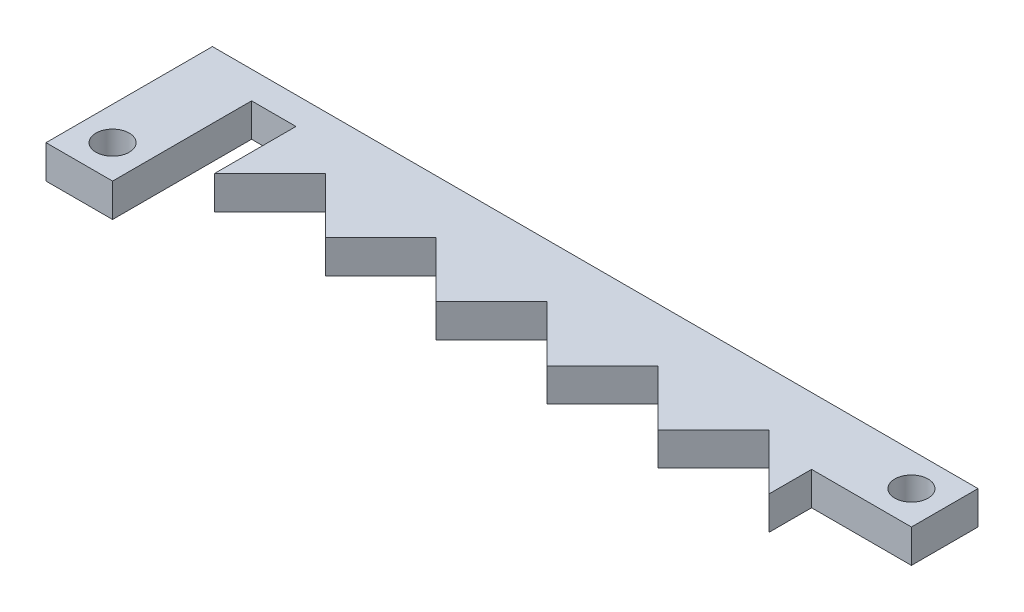
ISO-10303-21;
HEADER;
FILE_DESCRIPTION(('STEP AP214'),'2;1');
FILE_NAME('part.step','',(''),(''),'','','');
FILE_SCHEMA(('AUTOMOTIVE_DESIGN { 1 0 10303 214 1 1 1 1 }'));
ENDSEC;
DATA;
#1=APPLICATION_CONTEXT('core data for automotive mechanical design processes');
#2=APPLICATION_PROTOCOL_DEFINITION('international standard','automotive_design',2000,#1);
#3=PRODUCT_CONTEXT('',#1,'mechanical');
#4=PRODUCT('Part','Part','',(#3));
#5=PRODUCT_RELATED_PRODUCT_CATEGORY('part','',(#4));
#6=PRODUCT_DEFINITION_FORMATION('','',#4);
#7=PRODUCT_DEFINITION_CONTEXT('part definition',#1,'design');
#8=PRODUCT_DEFINITION('design','',#6,#7);
#9=PRODUCT_DEFINITION_SHAPE('','',#8);
#10=(LENGTH_UNIT() NAMED_UNIT(*) SI_UNIT(.MILLI.,.METRE.));
#11=(NAMED_UNIT(*) PLANE_ANGLE_UNIT() SI_UNIT($,.RADIAN.));
#12=(NAMED_UNIT(*) SI_UNIT($,.STERADIAN.) SOLID_ANGLE_UNIT());
#13=UNCERTAINTY_MEASURE_WITH_UNIT(LENGTH_MEASURE(1.E-05),#10,'distance_accuracy_value','');
#14=(GEOMETRIC_REPRESENTATION_CONTEXT(3) GLOBAL_UNCERTAINTY_ASSIGNED_CONTEXT((#13)) GLOBAL_UNIT_ASSIGNED_CONTEXT((#10,
#11,#12)) REPRESENTATION_CONTEXT('',''));
#15=CARTESIAN_POINT('',(0.,0.,0.));
#16=DIRECTION('',(0.,0.,1.));
#17=DIRECTION('',(1.,0.,0.));
#18=AXIS2_PLACEMENT_3D('',#15,#16,#17);
#19=CARTESIAN_POINT('',(0.,3.,0.));
#20=DIRECTION('',(0.,1.,0.));
#21=DIRECTION('',(0.,0.,1.));
#22=AXIS2_PLACEMENT_3D('',#19,#20,#21);
#23=PLANE('',#22);
#24=CARTESIAN_POINT('',(-7.,3.,-36.1687627456537));
#25=DIRECTION('',(0.,1.,0.));
#26=DIRECTION('',(0.,0.,1.));
#27=AXIS2_PLACEMENT_3D('',#24,#25,#26);
#28=CIRCLE('',#27,1.5);
#29=CARTESIAN_POINT('',(-7.,3.,-34.6687627456537));
#30=VERTEX_POINT('',#29);
#31=EDGE_CURVE('E200',#30,#30,#28,.T.);
#32=ORIENTED_EDGE('',*,*,#31,.F.);
#33=EDGE_LOOP('',(#32));
#34=FACE_BOUND('',#33,.T.);
#35=DIRECTION('',(-1.,0.,0.));
#36=VECTOR('',#35,1.);
#37=CARTESIAN_POINT('',(5.,3.,-48.1687627456537));
#38=LINE('',#37,#36);
#39=CARTESIAN_POINT('',(59.,3.,-48.1687627456537));
#40=VERTEX_POINT('',#39);
#41=CARTESIAN_POINT('',(-10.,3.,-48.1687627456537));
#42=VERTEX_POINT('',#41);
#43=EDGE_CURVE('E50',#40,#42,#38,.T.);
#44=ORIENTED_EDGE('',*,*,#43,.T.);
#45=DIRECTION('',(0.,0.,1.));
#46=VECTOR('',#45,1.);
#47=CARTESIAN_POINT('',(-10.,3.,-48.1687627456537));
#48=LINE('',#47,#46);
#49=CARTESIAN_POINT('',(-10.,3.,-33.1687627456537));
#50=VERTEX_POINT('',#49);
#51=EDGE_CURVE('E337',#42,#50,#48,.T.);
#52=ORIENTED_EDGE('',*,*,#51,.T.);
#53=DIRECTION('',(1.,0.,0.));
#54=VECTOR('',#53,1.);
#55=CARTESIAN_POINT('',(-10.,3.,-33.1687627456537));
#56=LINE('',#55,#54);
#57=CARTESIAN_POINT('',(-4.,3.,-33.1687627456537));
#58=VERTEX_POINT('',#57);
#59=EDGE_CURVE('E282',#50,#58,#56,.T.);
#60=ORIENTED_EDGE('',*,*,#59,.T.);
#61=DIRECTION('',(0.,0.,-1.));
#62=VECTOR('',#61,1.);
#63=CARTESIAN_POINT('',(-4.,3.,-33.1687627456537));
#64=LINE('',#63,#62);
#65=CARTESIAN_POINT('',(-4.00000000000006,3.,-45.6968116538911));
#66=VERTEX_POINT('',#65);
#67=EDGE_CURVE('E300',#58,#66,#64,.T.);
#68=ORIENTED_EDGE('',*,*,#67,.T.);
#69=DIRECTION('',(1.,0.,0.));
#70=VECTOR('',#69,1.);
#71=CARTESIAN_POINT('',(-4.00000000000006,3.,-45.6968116538911));
#72=LINE('',#71,#70);
#73=CARTESIAN_POINT('',(0.,3.,-45.6968116538911));
#74=VERTEX_POINT('',#73);
#75=EDGE_CURVE('E297',#66,#74,#72,.T.);
#76=ORIENTED_EDGE('',*,*,#75,.T.);
#77=DIRECTION('',(0.,0.,1.));
#78=VECTOR('',#77,1.);
#79=CARTESIAN_POINT('',(0.,3.,-42.3411545817203));
#80=LINE('',#79,#78);
#81=CARTESIAN_POINT('',(0.,3.,-38.3411545817203));
#82=VERTEX_POINT('',#81);
#83=EDGE_CURVE('E299',#74,#82,#80,.T.);
#84=ORIENTED_EDGE('',*,*,#83,.T.);
#85=DIRECTION('',(0.707106781186534,0.,-0.707106781186561));
#86=VECTOR('',#85,1.);
#87=CARTESIAN_POINT('',(0.,3.,-38.3411545817203));
#88=LINE('',#87,#86);
#89=CARTESIAN_POINT('',(4.99999999999981,3.,-43.3411545817203));
#90=VERTEX_POINT('',#89);
#91=EDGE_CURVE('E302',#82,#90,#88,.T.);
#92=ORIENTED_EDGE('',*,*,#91,.T.);
#93=DIRECTION('',(0.707106781186561,0.,0.707106781186534));
#94=VECTOR('',#93,1.);
#95=CARTESIAN_POINT('',(4.99999999999981,3.,-43.3411545817203));
#96=LINE('',#95,#94);
#97=CARTESIAN_POINT('',(10.,3.,-38.3411545817203));
#98=VERTEX_POINT('',#97);
#99=EDGE_CURVE('E308',#90,#98,#96,.T.);
#100=ORIENTED_EDGE('',*,*,#99,.T.);
#101=DIRECTION('',(0.707106781186534,0.,-0.707106781186561));
#102=VECTOR('',#101,1.);
#103=CARTESIAN_POINT('',(10.,3.,-38.3411545817203));
#104=LINE('',#103,#102);
#105=CARTESIAN_POINT('',(14.9999999999998,3.,-43.3411545817203));
#106=VERTEX_POINT('',#105);
#107=EDGE_CURVE('E310',#98,#106,#104,.T.);
#108=ORIENTED_EDGE('',*,*,#107,.T.);
#109=DIRECTION('',(0.707106781186561,0.,0.707106781186535));
#110=VECTOR('',#109,1.);
#111=CARTESIAN_POINT('',(14.9999999999998,3.,-43.3411545817203));
#112=LINE('',#111,#110);
#113=CARTESIAN_POINT('',(20.,3.,-38.3411545817203));
#114=VERTEX_POINT('',#113);
#115=EDGE_CURVE('E312',#106,#114,#112,.T.);
#116=ORIENTED_EDGE('',*,*,#115,.T.);
#117=DIRECTION('',(0.707106781186534,0.,-0.707106781186561));
#118=VECTOR('',#117,1.);
#119=CARTESIAN_POINT('',(20.,3.,-38.3411545817203));
#120=LINE('',#119,#118);
#121=CARTESIAN_POINT('',(24.9999999999998,3.,-43.3411545817203));
#122=VERTEX_POINT('',#121);
#123=EDGE_CURVE('E314',#114,#122,#120,.T.);
#124=ORIENTED_EDGE('',*,*,#123,.T.);
#125=DIRECTION('',(0.707106781186561,0.,0.707106781186535));
#126=VECTOR('',#125,1.);
#127=CARTESIAN_POINT('',(24.9999999999998,3.,-43.3411545817203));
#128=LINE('',#127,#126);
#129=CARTESIAN_POINT('',(30.,3.,-38.3411545817203));
#130=VERTEX_POINT('',#129);
#131=EDGE_CURVE('E316',#122,#130,#128,.T.);
#132=ORIENTED_EDGE('',*,*,#131,.T.);
#133=DIRECTION('',(0.707106781186534,0.,-0.707106781186561));
#134=VECTOR('',#133,1.);
#135=CARTESIAN_POINT('',(30.,3.,-38.3411545817203));
#136=LINE('',#135,#134);
#137=CARTESIAN_POINT('',(34.9999999999998,3.,-43.3411545817203));
#138=VERTEX_POINT('',#137);
#139=EDGE_CURVE('E318',#130,#138,#136,.T.);
#140=ORIENTED_EDGE('',*,*,#139,.T.);
#141=DIRECTION('',(0.70710678118656,0.,0.707106781186535));
#142=VECTOR('',#141,1.);
#143=CARTESIAN_POINT('',(34.9999999999998,3.,-43.3411545817203));
#144=LINE('',#143,#142);
#145=CARTESIAN_POINT('',(40.,3.,-38.3411545817203));
#146=VERTEX_POINT('',#145);
#147=EDGE_CURVE('E320',#138,#146,#144,.T.);
#148=ORIENTED_EDGE('',*,*,#147,.T.);
#149=DIRECTION('',(0.707106781186534,0.,-0.707106781186561));
#150=VECTOR('',#149,1.);
#151=CARTESIAN_POINT('',(40.,3.,-38.3411545817203));
#152=LINE('',#151,#150);
#153=CARTESIAN_POINT('',(44.9999999999998,3.,-43.3411545817203));
#154=VERTEX_POINT('',#153);
#155=EDGE_CURVE('E322',#146,#154,#152,.T.);
#156=ORIENTED_EDGE('',*,*,#155,.T.);
#157=DIRECTION('',(0.70710678118656,0.,0.707106781186535));
#158=VECTOR('',#157,1.);
#159=CARTESIAN_POINT('',(44.9999999999998,3.,-43.3411545817203));
#160=LINE('',#159,#158);
#161=CARTESIAN_POINT('',(50.,3.,-38.3411545817203));
#162=VERTEX_POINT('',#161);
#163=EDGE_CURVE('E177',#154,#162,#160,.T.);
#164=ORIENTED_EDGE('',*,*,#163,.T.);
#165=DIRECTION('',(0.,0.,-1.));
#166=VECTOR('',#165,1.);
#167=CARTESIAN_POINT('',(50.,3.,-42.1687627456537));
#168=LINE('',#167,#166);
#169=CARTESIAN_POINT('',(50.,3.,-42.1687627456537));
#170=VERTEX_POINT('',#169);
#171=EDGE_CURVE('E171',#162,#170,#168,.T.);
#172=ORIENTED_EDGE('',*,*,#171,.T.);
#173=DIRECTION('',(1.,0.,0.));
#174=VECTOR('',#173,1.);
#175=CARTESIAN_POINT('',(59.,3.,-42.1687627456537));
#176=LINE('',#175,#174);
#177=CARTESIAN_POINT('',(59.,3.,-42.1687627456537));
#178=VERTEX_POINT('',#177);
#179=EDGE_CURVE('E175',#170,#178,#176,.T.);
#180=ORIENTED_EDGE('',*,*,#179,.T.);
#181=DIRECTION('',(0.,0.,-1.));
#182=VECTOR('',#181,1.);
#183=CARTESIAN_POINT('',(59.,3.,-48.1687627456537));
#184=LINE('',#183,#182);
#185=EDGE_CURVE('E191',#178,#40,#184,.T.);
#186=ORIENTED_EDGE('',*,*,#185,.T.);
#187=EDGE_LOOP('',(#44,#52,#60,#68,#76,#84,#92,#100,#108,#116,#124,#132,#140,#148,#156,#164,
#172,#180,#186));
#188=FACE_BOUND('',#187,.T.);
#189=CARTESIAN_POINT('',(56.,3.,-45.1687627456537));
#190=DIRECTION('',(0.,1.,0.));
#191=DIRECTION('',(0.,0.,1.));
#192=AXIS2_PLACEMENT_3D('',#189,#190,#191);
#193=CIRCLE('',#192,1.5);
#194=CARTESIAN_POINT('',(56.,3.,-43.6687627456537));
#195=VERTEX_POINT('',#194);
#196=EDGE_CURVE('E344',#195,#195,#193,.T.);
#197=ORIENTED_EDGE('',*,*,#196,.F.);
#198=EDGE_LOOP('',(#197));
#199=FACE_BOUND('',#198,.T.);
#200=ADVANCED_FACE('F33',(#34,#188,#199),#23,.T.);
#201=CARTESIAN_POINT('',(0.,0.,0.));
#202=DIRECTION('',(0.,1.,0.));
#203=DIRECTION('',(0.,0.,1.));
#204=AXIS2_PLACEMENT_3D('',#201,#202,#203);
#205=PLANE('',#204);
#206=DIRECTION('',(0.,0.,1.));
#207=VECTOR('',#206,1.);
#208=CARTESIAN_POINT('',(-10.,0.,-48.1687627456537));
#209=LINE('',#208,#207);
#210=CARTESIAN_POINT('',(-10.,0.,-48.1687627456537));
#211=VERTEX_POINT('',#210);
#212=CARTESIAN_POINT('',(-10.,0.,-33.1687627456537));
#213=VERTEX_POINT('',#212);
#214=EDGE_CURVE('E197',#211,#213,#209,.T.);
#215=ORIENTED_EDGE('',*,*,#214,.F.);
#216=DIRECTION('',(-1.,0.,0.));
#217=VECTOR('',#216,1.);
#218=CARTESIAN_POINT('',(5.,0.,-48.1687627456537));
#219=LINE('',#218,#217);
#220=CARTESIAN_POINT('',(59.,0.,-48.1687627456537));
#221=VERTEX_POINT('',#220);
#222=EDGE_CURVE('E120',#221,#211,#219,.T.);
#223=ORIENTED_EDGE('',*,*,#222,.F.);
#224=DIRECTION('',(0.,0.,-1.));
#225=VECTOR('',#224,1.);
#226=CARTESIAN_POINT('',(59.,0.,-48.1687627456537));
#227=LINE('',#226,#225);
#228=CARTESIAN_POINT('',(59.,0.,-42.1687627456537));
#229=VERTEX_POINT('',#228);
#230=EDGE_CURVE('E231',#229,#221,#227,.T.);
#231=ORIENTED_EDGE('',*,*,#230,.F.);
#232=DIRECTION('',(1.,0.,0.));
#233=VECTOR('',#232,1.);
#234=CARTESIAN_POINT('',(59.,0.,-42.1687627456537));
#235=LINE('',#234,#233);
#236=CARTESIAN_POINT('',(50.,0.,-42.1687627456537));
#237=VERTEX_POINT('',#236);
#238=EDGE_CURVE('E113',#237,#229,#235,.T.);
#239=ORIENTED_EDGE('',*,*,#238,.F.);
#240=DIRECTION('',(0.,0.,-1.));
#241=VECTOR('',#240,1.);
#242=CARTESIAN_POINT('',(50.,0.,-42.1687627456537));
#243=LINE('',#242,#241);
#244=CARTESIAN_POINT('',(50.,0.,-38.3411545817203));
#245=VERTEX_POINT('',#244);
#246=EDGE_CURVE('E185',#245,#237,#243,.T.);
#247=ORIENTED_EDGE('',*,*,#246,.F.);
#248=DIRECTION('',(0.70710678118656,0.,0.707106781186535));
#249=VECTOR('',#248,1.);
#250=CARTESIAN_POINT('',(44.9999999999998,0.,-43.3411545817203));
#251=LINE('',#250,#249);
#252=CARTESIAN_POINT('',(44.9999999999998,0.,-43.3411545817203));
#253=VERTEX_POINT('',#252);
#254=EDGE_CURVE('E227',#253,#245,#251,.T.);
#255=ORIENTED_EDGE('',*,*,#254,.F.);
#256=DIRECTION('',(0.707106781186534,0.,-0.707106781186561));
#257=VECTOR('',#256,1.);
#258=CARTESIAN_POINT('',(40.,0.,-38.3411545817203));
#259=LINE('',#258,#257);
#260=CARTESIAN_POINT('',(40.,0.,-38.3411545817203));
#261=VERTEX_POINT('',#260);
#262=EDGE_CURVE('E225',#261,#253,#259,.T.);
#263=ORIENTED_EDGE('',*,*,#262,.F.);
#264=DIRECTION('',(0.70710678118656,0.,0.707106781186535));
#265=VECTOR('',#264,1.);
#266=CARTESIAN_POINT('',(34.9999999999998,0.,-43.3411545817203));
#267=LINE('',#266,#265);
#268=CARTESIAN_POINT('',(34.9999999999998,0.,-43.3411545817203));
#269=VERTEX_POINT('',#268);
#270=EDGE_CURVE('E223',#269,#261,#267,.T.);
#271=ORIENTED_EDGE('',*,*,#270,.F.);
#272=DIRECTION('',(0.707106781186534,0.,-0.707106781186561));
#273=VECTOR('',#272,1.);
#274=CARTESIAN_POINT('',(30.,0.,-38.3411545817203));
#275=LINE('',#274,#273);
#276=CARTESIAN_POINT('',(30.,0.,-38.3411545817203));
#277=VERTEX_POINT('',#276);
#278=EDGE_CURVE('E221',#277,#269,#275,.T.);
#279=ORIENTED_EDGE('',*,*,#278,.F.);
#280=DIRECTION('',(0.707106781186561,0.,0.707106781186535));
#281=VECTOR('',#280,1.);
#282=CARTESIAN_POINT('',(24.9999999999998,0.,-43.3411545817203));
#283=LINE('',#282,#281);
#284=CARTESIAN_POINT('',(24.9999999999998,0.,-43.3411545817203));
#285=VERTEX_POINT('',#284);
#286=EDGE_CURVE('E219',#285,#277,#283,.T.);
#287=ORIENTED_EDGE('',*,*,#286,.F.);
#288=DIRECTION('',(0.707106781186534,0.,-0.707106781186561));
#289=VECTOR('',#288,1.);
#290=CARTESIAN_POINT('',(20.,0.,-38.3411545817203));
#291=LINE('',#290,#289);
#292=CARTESIAN_POINT('',(20.,0.,-38.3411545817203));
#293=VERTEX_POINT('',#292);
#294=EDGE_CURVE('E217',#293,#285,#291,.T.);
#295=ORIENTED_EDGE('',*,*,#294,.F.);
#296=DIRECTION('',(0.707106781186561,0.,0.707106781186535));
#297=VECTOR('',#296,1.);
#298=CARTESIAN_POINT('',(14.9999999999998,0.,-43.3411545817203));
#299=LINE('',#298,#297);
#300=CARTESIAN_POINT('',(14.9999999999998,0.,-43.3411545817203));
#301=VERTEX_POINT('',#300);
#302=EDGE_CURVE('E215',#301,#293,#299,.T.);
#303=ORIENTED_EDGE('',*,*,#302,.F.);
#304=DIRECTION('',(0.707106781186534,0.,-0.707106781186561));
#305=VECTOR('',#304,1.);
#306=CARTESIAN_POINT('',(10.,0.,-38.3411545817203));
#307=LINE('',#306,#305);
#308=CARTESIAN_POINT('',(10.,0.,-38.3411545817203));
#309=VERTEX_POINT('',#308);
#310=EDGE_CURVE('E213',#309,#301,#307,.T.);
#311=ORIENTED_EDGE('',*,*,#310,.F.);
#312=DIRECTION('',(0.707106781186561,0.,0.707106781186534));
#313=VECTOR('',#312,1.);
#314=CARTESIAN_POINT('',(4.99999999999981,0.,-43.3411545817203));
#315=LINE('',#314,#313);
#316=CARTESIAN_POINT('',(4.99999999999981,0.,-43.3411545817203));
#317=VERTEX_POINT('',#316);
#318=EDGE_CURVE('E211',#317,#309,#315,.T.);
#319=ORIENTED_EDGE('',*,*,#318,.F.);
#320=DIRECTION('',(0.707106781186534,0.,-0.707106781186561));
#321=VECTOR('',#320,1.);
#322=CARTESIAN_POINT('',(0.,0.,-38.3411545817203));
#323=LINE('',#322,#321);
#324=CARTESIAN_POINT('',(0.,0.,-38.3411545817203));
#325=VERTEX_POINT('',#324);
#326=EDGE_CURVE('E209',#325,#317,#323,.T.);
#327=ORIENTED_EDGE('',*,*,#326,.F.);
#328=DIRECTION('',(0.,0.,1.));
#329=VECTOR('',#328,1.);
#330=CARTESIAN_POINT('',(0.,0.,-42.3411545817203));
#331=LINE('',#330,#329);
#332=CARTESIAN_POINT('',(0.,0.,-45.6968116538911));
#333=VERTEX_POINT('',#332);
#334=EDGE_CURVE('E207',#333,#325,#331,.T.);
#335=ORIENTED_EDGE('',*,*,#334,.F.);
#336=DIRECTION('',(1.,0.,0.));
#337=VECTOR('',#336,1.);
#338=CARTESIAN_POINT('',(-4.00000000000006,0.,-45.6968116538911));
#339=LINE('',#338,#337);
#340=CARTESIAN_POINT('',(-4.00000000000006,0.,-45.6968116538911));
#341=VERTEX_POINT('',#340);
#342=EDGE_CURVE('E204',#341,#333,#339,.T.);
#343=ORIENTED_EDGE('',*,*,#342,.F.);
#344=DIRECTION('',(0.,0.,-1.));
#345=VECTOR('',#344,1.);
#346=CARTESIAN_POINT('',(-4.,0.,-33.1687627456537));
#347=LINE('',#346,#345);
#348=CARTESIAN_POINT('',(-4.,0.,-33.1687627456537));
#349=VERTEX_POINT('',#348);
#350=EDGE_CURVE('E202',#349,#341,#347,.T.);
#351=ORIENTED_EDGE('',*,*,#350,.F.);
#352=DIRECTION('',(1.,0.,0.));
#353=VECTOR('',#352,1.);
#354=CARTESIAN_POINT('',(-10.,0.,-33.1687627456537));
#355=LINE('',#354,#353);
#356=EDGE_CURVE('E199',#213,#349,#355,.T.);
#357=ORIENTED_EDGE('',*,*,#356,.F.);
#358=EDGE_LOOP('',(#215,#223,#231,#239,#247,#255,#263,#271,#279,#287,#295,#303,#311,#319,#327,
#335,#343,#351,#357));
#359=FACE_BOUND('',#358,.T.);
#360=CARTESIAN_POINT('',(-7.,0.,-36.1687627456537));
#361=DIRECTION('',(0.,1.,0.));
#362=DIRECTION('',(0.,0.,1.));
#363=AXIS2_PLACEMENT_3D('',#360,#361,#362);
#364=CIRCLE('',#363,1.5);
#365=CARTESIAN_POINT('',(-7.,0.,-34.6687627456537));
#366=VERTEX_POINT('',#365);
#367=EDGE_CURVE('E341',#366,#366,#364,.T.);
#368=ORIENTED_EDGE('',*,*,#367,.T.);
#369=EDGE_LOOP('',(#368));
#370=FACE_BOUND('',#369,.T.);
#371=CARTESIAN_POINT('',(56.,0.,-45.1687627456537));
#372=DIRECTION('',(0.,1.,0.));
#373=DIRECTION('',(0.,0.,1.));
#374=AXIS2_PLACEMENT_3D('',#371,#372,#373);
#375=CIRCLE('',#374,1.5);
#376=CARTESIAN_POINT('',(56.,0.,-43.6687627456537));
#377=VERTEX_POINT('',#376);
#378=EDGE_CURVE('E347',#377,#377,#375,.T.);
#379=ORIENTED_EDGE('',*,*,#378,.T.);
#380=EDGE_LOOP('',(#379));
#381=FACE_BOUND('',#380,.T.);
#382=ADVANCED_FACE('F286',(#359,#370,#381),#205,.F.);
#383=CARTESIAN_POINT('',(-10.,3.,-48.1687627456537));
#384=DIRECTION('',(1.,0.,0.));
#385=DIRECTION('',(0.,0.,-1.));
#386=AXIS2_PLACEMENT_3D('',#383,#384,#385);
#387=PLANE('',#386);
#388=ORIENTED_EDGE('',*,*,#214,.T.);
#389=DIRECTION('',(0.,-1.,0.));
#390=VECTOR('',#389,1.);
#391=CARTESIAN_POINT('',(-10.,3.,-33.1687627456537));
#392=LINE('',#391,#390);
#393=EDGE_CURVE('E42',#50,#213,#392,.T.);
#394=ORIENTED_EDGE('',*,*,#393,.F.);
#395=ORIENTED_EDGE('',*,*,#51,.F.);
#396=DIRECTION('',(0.,-1.,0.));
#397=VECTOR('',#396,1.);
#398=CARTESIAN_POINT('',(-10.,3.,-48.1687627456537));
#399=LINE('',#398,#397);
#400=EDGE_CURVE('E11',#42,#211,#399,.T.);
#401=ORIENTED_EDGE('',*,*,#400,.T.);
#402=EDGE_LOOP('',(#388,#394,#395,#401));
#403=FACE_BOUND('',#402,.T.);
#404=ADVANCED_FACE('F35',(#403),#387,.F.);
#405=CARTESIAN_POINT('',(-10.,3.,-33.1687627456537));
#406=DIRECTION('',(0.,0.,-1.));
#407=DIRECTION('',(-1.,0.,0.));
#408=AXIS2_PLACEMENT_3D('',#405,#406,#407);
#409=PLANE('',#408);
#410=ORIENTED_EDGE('',*,*,#356,.T.);
#411=DIRECTION('',(0.,-1.,0.));
#412=VECTOR('',#411,1.);
#413=CARTESIAN_POINT('',(-4.,3.,-33.1687627456537));
#414=LINE('',#413,#412);
#415=EDGE_CURVE('E273',#58,#349,#414,.T.);
#416=ORIENTED_EDGE('',*,*,#415,.F.);
#417=ORIENTED_EDGE('',*,*,#59,.F.);
#418=ORIENTED_EDGE('',*,*,#393,.T.);
#419=EDGE_LOOP('',(#410,#416,#417,#418));
#420=FACE_BOUND('',#419,.T.);
#421=ADVANCED_FACE('F280',(#420),#409,.F.);
#422=CARTESIAN_POINT('',(-4.,3.,-33.1687627456537));
#423=DIRECTION('',(-1.,0.,0.));
#424=DIRECTION('',(0.,0.,1.));
#425=AXIS2_PLACEMENT_3D('',#422,#423,#424);
#426=PLANE('',#425);
#427=ORIENTED_EDGE('',*,*,#350,.T.);
#428=DIRECTION('',(0.,-1.,0.));
#429=VECTOR('',#428,1.);
#430=CARTESIAN_POINT('',(-4.00000000000006,3.,-45.6968116538911));
#431=LINE('',#430,#429);
#432=EDGE_CURVE('E270',#66,#341,#431,.T.);
#433=ORIENTED_EDGE('',*,*,#432,.F.);
#434=ORIENTED_EDGE('',*,*,#67,.F.);
#435=ORIENTED_EDGE('',*,*,#415,.T.);
#436=EDGE_LOOP('',(#427,#433,#434,#435));
#437=FACE_BOUND('',#436,.T.);
#438=ADVANCED_FACE('F291',(#437),#426,.F.);
#439=CARTESIAN_POINT('',(-4.00000000000006,3.,-45.6968116538911));
#440=DIRECTION('',(0.,0.,-1.));
#441=DIRECTION('',(-1.,0.,0.));
#442=AXIS2_PLACEMENT_3D('',#439,#440,#441);
#443=PLANE('',#442);
#444=ORIENTED_EDGE('',*,*,#342,.T.);
#445=DIRECTION('',(0.,-1.,0.));
#446=VECTOR('',#445,1.);
#447=CARTESIAN_POINT('',(0.,3.,-45.6968116538911));
#448=LINE('',#447,#446);
#449=EDGE_CURVE('E267',#74,#333,#448,.T.);
#450=ORIENTED_EDGE('',*,*,#449,.F.);
#451=ORIENTED_EDGE('',*,*,#75,.F.);
#452=ORIENTED_EDGE('',*,*,#432,.T.);
#453=EDGE_LOOP('',(#444,#450,#451,#452));
#454=FACE_BOUND('',#453,.T.);
#455=ADVANCED_FACE('F295',(#454),#443,.F.);
#456=CARTESIAN_POINT('',(0.,3.,-42.3411545817203));
#457=DIRECTION('',(1.,0.,0.));
#458=DIRECTION('',(0.,0.,-1.));
#459=AXIS2_PLACEMENT_3D('',#456,#457,#458);
#460=PLANE('',#459);
#461=ORIENTED_EDGE('',*,*,#334,.T.);
#462=DIRECTION('',(0.,-1.,0.));
#463=VECTOR('',#462,1.);
#464=CARTESIAN_POINT('',(0.,3.,-38.3411545817203));
#465=LINE('',#464,#463);
#466=EDGE_CURVE('E264',#82,#325,#465,.T.);
#467=ORIENTED_EDGE('',*,*,#466,.F.);
#468=ORIENTED_EDGE('',*,*,#83,.F.);
#469=ORIENTED_EDGE('',*,*,#449,.T.);
#470=EDGE_LOOP('',(#461,#467,#468,#469));
#471=FACE_BOUND('',#470,.T.);
#472=ADVANCED_FACE('F410',(#471),#460,.F.);
#473=CARTESIAN_POINT('',(0.,3.,-38.3411545817203));
#474=DIRECTION('',(-0.707106781186561,0.,-0.707106781186534));
#475=DIRECTION('',(-0.707106781186534,0.,0.707106781186561));
#476=AXIS2_PLACEMENT_3D('',#473,#474,#475);
#477=PLANE('',#476);
#478=ORIENTED_EDGE('',*,*,#326,.T.);
#479=DIRECTION('',(0.,-1.,0.));
#480=VECTOR('',#479,1.);
#481=CARTESIAN_POINT('',(4.99999999999981,3.,-43.3411545817203));
#482=LINE('',#481,#480);
#483=EDGE_CURVE('E261',#90,#317,#482,.T.);
#484=ORIENTED_EDGE('',*,*,#483,.F.);
#485=ORIENTED_EDGE('',*,*,#91,.F.);
#486=ORIENTED_EDGE('',*,*,#466,.T.);
#487=EDGE_LOOP('',(#478,#484,#485,#486));
#488=FACE_BOUND('',#487,.T.);
#489=ADVANCED_FACE('F406',(#488),#477,.F.);
#490=CARTESIAN_POINT('',(4.99999999999981,3.,-43.3411545817203));
#491=DIRECTION('',(0.707106781186534,0.,-0.707106781186561));
#492=DIRECTION('',(-0.707106781186561,0.,-0.707106781186534));
#493=AXIS2_PLACEMENT_3D('',#490,#491,#492);
#494=PLANE('',#493);
#495=ORIENTED_EDGE('',*,*,#318,.T.);
#496=DIRECTION('',(0.,-1.,0.));
#497=VECTOR('',#496,1.);
#498=CARTESIAN_POINT('',(10.,3.,-38.3411545817203));
#499=LINE('',#498,#497);
#500=EDGE_CURVE('E258',#98,#309,#499,.T.);
#501=ORIENTED_EDGE('',*,*,#500,.F.);
#502=ORIENTED_EDGE('',*,*,#99,.F.);
#503=ORIENTED_EDGE('',*,*,#483,.T.);
#504=EDGE_LOOP('',(#495,#501,#502,#503));
#505=FACE_BOUND('',#504,.T.);
#506=ADVANCED_FACE('F402',(#505),#494,.F.);
#507=CARTESIAN_POINT('',(10.,3.,-38.3411545817203));
#508=DIRECTION('',(-0.707106781186561,0.,-0.707106781186534));
#509=DIRECTION('',(-0.707106781186534,0.,0.707106781186561));
#510=AXIS2_PLACEMENT_3D('',#507,#508,#509);
#511=PLANE('',#510);
#512=ORIENTED_EDGE('',*,*,#310,.T.);
#513=DIRECTION('',(0.,-1.,0.));
#514=VECTOR('',#513,1.);
#515=CARTESIAN_POINT('',(14.9999999999998,3.,-43.3411545817203));
#516=LINE('',#515,#514);
#517=EDGE_CURVE('E255',#106,#301,#516,.T.);
#518=ORIENTED_EDGE('',*,*,#517,.F.);
#519=ORIENTED_EDGE('',*,*,#107,.F.);
#520=ORIENTED_EDGE('',*,*,#500,.T.);
#521=EDGE_LOOP('',(#512,#518,#519,#520));
#522=FACE_BOUND('',#521,.T.);
#523=ADVANCED_FACE('F398',(#522),#511,.F.);
#524=CARTESIAN_POINT('',(14.9999999999998,3.,-43.3411545817203));
#525=DIRECTION('',(0.707106781186534,0.,-0.70710678118656));
#526=DIRECTION('',(-0.707106781186561,0.,-0.707106781186535));
#527=AXIS2_PLACEMENT_3D('',#524,#525,#526);
#528=PLANE('',#527);
#529=ORIENTED_EDGE('',*,*,#302,.T.);
#530=DIRECTION('',(0.,-1.,0.));
#531=VECTOR('',#530,1.);
#532=CARTESIAN_POINT('',(20.,3.,-38.3411545817203));
#533=LINE('',#532,#531);
#534=EDGE_CURVE('E252',#114,#293,#533,.T.);
#535=ORIENTED_EDGE('',*,*,#534,.F.);
#536=ORIENTED_EDGE('',*,*,#115,.F.);
#537=ORIENTED_EDGE('',*,*,#517,.T.);
#538=EDGE_LOOP('',(#529,#535,#536,#537));
#539=FACE_BOUND('',#538,.T.);
#540=ADVANCED_FACE('F394',(#539),#528,.F.);
#541=CARTESIAN_POINT('',(20.,3.,-38.3411545817203));
#542=DIRECTION('',(-0.707106781186561,0.,-0.707106781186534));
#543=DIRECTION('',(-0.707106781186534,0.,0.707106781186561));
#544=AXIS2_PLACEMENT_3D('',#541,#542,#543);
#545=PLANE('',#544);
#546=ORIENTED_EDGE('',*,*,#294,.T.);
#547=DIRECTION('',(0.,-1.,0.));
#548=VECTOR('',#547,1.);
#549=CARTESIAN_POINT('',(24.9999999999998,3.,-43.3411545817203));
#550=LINE('',#549,#548);
#551=EDGE_CURVE('E249',#122,#285,#550,.T.);
#552=ORIENTED_EDGE('',*,*,#551,.F.);
#553=ORIENTED_EDGE('',*,*,#123,.F.);
#554=ORIENTED_EDGE('',*,*,#534,.T.);
#555=EDGE_LOOP('',(#546,#552,#553,#554));
#556=FACE_BOUND('',#555,.T.);
#557=ADVANCED_FACE('F390',(#556),#545,.F.);
#558=CARTESIAN_POINT('',(24.9999999999998,3.,-43.3411545817203));
#559=DIRECTION('',(0.707106781186534,0.,-0.70710678118656));
#560=DIRECTION('',(-0.707106781186561,0.,-0.707106781186535));
#561=AXIS2_PLACEMENT_3D('',#558,#559,#560);
#562=PLANE('',#561);
#563=ORIENTED_EDGE('',*,*,#286,.T.);
#564=DIRECTION('',(0.,-1.,0.));
#565=VECTOR('',#564,1.);
#566=CARTESIAN_POINT('',(30.,3.,-38.3411545817203));
#567=LINE('',#566,#565);
#568=EDGE_CURVE('E246',#130,#277,#567,.T.);
#569=ORIENTED_EDGE('',*,*,#568,.F.);
#570=ORIENTED_EDGE('',*,*,#131,.F.);
#571=ORIENTED_EDGE('',*,*,#551,.T.);
#572=EDGE_LOOP('',(#563,#569,#570,#571));
#573=FACE_BOUND('',#572,.T.);
#574=ADVANCED_FACE('F386',(#573),#562,.F.);
#575=CARTESIAN_POINT('',(30.,3.,-38.3411545817203));
#576=DIRECTION('',(-0.707106781186561,0.,-0.707106781186534));
#577=DIRECTION('',(-0.707106781186534,0.,0.707106781186561));
#578=AXIS2_PLACEMENT_3D('',#575,#576,#577);
#579=PLANE('',#578);
#580=ORIENTED_EDGE('',*,*,#278,.T.);
#581=DIRECTION('',(0.,-1.,0.));
#582=VECTOR('',#581,1.);
#583=CARTESIAN_POINT('',(34.9999999999998,3.,-43.3411545817203));
#584=LINE('',#583,#582);
#585=EDGE_CURVE('E243',#138,#269,#584,.T.);
#586=ORIENTED_EDGE('',*,*,#585,.F.);
#587=ORIENTED_EDGE('',*,*,#139,.F.);
#588=ORIENTED_EDGE('',*,*,#568,.T.);
#589=EDGE_LOOP('',(#580,#586,#587,#588));
#590=FACE_BOUND('',#589,.T.);
#591=ADVANCED_FACE('F382',(#590),#579,.F.);
#592=CARTESIAN_POINT('',(34.9999999999998,3.,-43.3411545817203));
#593=DIRECTION('',(0.707106781186535,0.,-0.70710678118656));
#594=DIRECTION('',(-0.70710678118656,0.,-0.707106781186535));
#595=AXIS2_PLACEMENT_3D('',#592,#593,#594);
#596=PLANE('',#595);
#597=ORIENTED_EDGE('',*,*,#270,.T.);
#598=DIRECTION('',(0.,-1.,0.));
#599=VECTOR('',#598,1.);
#600=CARTESIAN_POINT('',(40.,3.,-38.3411545817203));
#601=LINE('',#600,#599);
#602=EDGE_CURVE('E240',#146,#261,#601,.T.);
#603=ORIENTED_EDGE('',*,*,#602,.F.);
#604=ORIENTED_EDGE('',*,*,#147,.F.);
#605=ORIENTED_EDGE('',*,*,#585,.T.);
#606=EDGE_LOOP('',(#597,#603,#604,#605));
#607=FACE_BOUND('',#606,.T.);
#608=ADVANCED_FACE('F379',(#607),#596,.F.);
#609=CARTESIAN_POINT('',(40.,3.,-38.3411545817203));
#610=DIRECTION('',(-0.707106781186561,0.,-0.707106781186534));
#611=DIRECTION('',(-0.707106781186534,0.,0.707106781186561));
#612=AXIS2_PLACEMENT_3D('',#609,#610,#611);
#613=PLANE('',#612);
#614=ORIENTED_EDGE('',*,*,#262,.T.);
#615=DIRECTION('',(0.,-1.,0.));
#616=VECTOR('',#615,1.);
#617=CARTESIAN_POINT('',(44.9999999999998,3.,-43.3411545817203));
#618=LINE('',#617,#616);
#619=EDGE_CURVE('E237',#154,#253,#618,.T.);
#620=ORIENTED_EDGE('',*,*,#619,.F.);
#621=ORIENTED_EDGE('',*,*,#155,.F.);
#622=ORIENTED_EDGE('',*,*,#602,.T.);
#623=EDGE_LOOP('',(#614,#620,#621,#622));
#624=FACE_BOUND('',#623,.T.);
#625=ADVANCED_FACE('F328',(#624),#613,.F.);
#626=CARTESIAN_POINT('',(44.9999999999998,3.,-43.3411545817203));
#627=DIRECTION('',(0.707106781186535,0.,-0.70710678118656));
#628=DIRECTION('',(-0.70710678118656,0.,-0.707106781186535));
#629=AXIS2_PLACEMENT_3D('',#626,#627,#628);
#630=PLANE('',#629);
#631=ORIENTED_EDGE('',*,*,#254,.T.);
#632=DIRECTION('',(0.,-1.,0.));
#633=VECTOR('',#632,1.);
#634=CARTESIAN_POINT('',(50.,3.,-38.3411545817203));
#635=LINE('',#634,#633);
#636=EDGE_CURVE('E186',#162,#245,#635,.T.);
#637=ORIENTED_EDGE('',*,*,#636,.F.);
#638=ORIENTED_EDGE('',*,*,#163,.F.);
#639=ORIENTED_EDGE('',*,*,#619,.T.);
#640=EDGE_LOOP('',(#631,#637,#638,#639));
#641=FACE_BOUND('',#640,.T.);
#642=ADVANCED_FACE('F332',(#641),#630,.F.);
#643=CARTESIAN_POINT('',(50.,3.,-42.1687627456537));
#644=DIRECTION('',(-1.,0.,0.));
#645=DIRECTION('',(0.,0.,1.));
#646=AXIS2_PLACEMENT_3D('',#643,#644,#645);
#647=PLANE('',#646);
#648=ORIENTED_EDGE('',*,*,#246,.T.);
#649=DIRECTION('',(0.,-1.,0.));
#650=VECTOR('',#649,1.);
#651=CARTESIAN_POINT('',(50.,3.,-42.1687627456537));
#652=LINE('',#651,#650);
#653=EDGE_CURVE('E182',#170,#237,#652,.T.);
#654=ORIENTED_EDGE('',*,*,#653,.F.);
#655=ORIENTED_EDGE('',*,*,#171,.F.);
#656=ORIENTED_EDGE('',*,*,#636,.T.);
#657=EDGE_LOOP('',(#648,#654,#655,#656));
#658=FACE_BOUND('',#657,.T.);
#659=ADVANCED_FACE('F183',(#658),#647,.F.);
#660=CARTESIAN_POINT('',(59.,3.,-42.1687627456537));
#661=DIRECTION('',(0.,0.,-1.));
#662=DIRECTION('',(-1.,0.,0.));
#663=AXIS2_PLACEMENT_3D('',#660,#661,#662);
#664=PLANE('',#663);
#665=ORIENTED_EDGE('',*,*,#238,.T.);
#666=DIRECTION('',(0.,-1.,0.));
#667=VECTOR('',#666,1.);
#668=CARTESIAN_POINT('',(59.,3.,-42.1687627456537));
#669=LINE('',#668,#667);
#670=EDGE_CURVE('E187',#178,#229,#669,.T.);
#671=ORIENTED_EDGE('',*,*,#670,.F.);
#672=ORIENTED_EDGE('',*,*,#179,.F.);
#673=ORIENTED_EDGE('',*,*,#653,.T.);
#674=EDGE_LOOP('',(#665,#671,#672,#673));
#675=FACE_BOUND('',#674,.T.);
#676=ADVANCED_FACE('F189',(#675),#664,.F.);
#677=CARTESIAN_POINT('',(59.,3.,-48.1687627456537));
#678=DIRECTION('',(-1.,0.,0.));
#679=DIRECTION('',(0.,0.,1.));
#680=AXIS2_PLACEMENT_3D('',#677,#678,#679);
#681=PLANE('',#680);
#682=ORIENTED_EDGE('',*,*,#230,.T.);
#683=DIRECTION('',(0.,-1.,0.));
#684=VECTOR('',#683,1.);
#685=CARTESIAN_POINT('',(59.,3.,-48.1687627456537));
#686=LINE('',#685,#684);
#687=EDGE_CURVE('E193',#40,#221,#686,.T.);
#688=ORIENTED_EDGE('',*,*,#687,.F.);
#689=ORIENTED_EDGE('',*,*,#185,.F.);
#690=ORIENTED_EDGE('',*,*,#670,.T.);
#691=EDGE_LOOP('',(#682,#688,#689,#690));
#692=FACE_BOUND('',#691,.T.);
#693=ADVANCED_FACE('F335',(#692),#681,.F.);
#694=CARTESIAN_POINT('',(5.,3.,-48.1687627456537));
#695=DIRECTION('',(0.,0.,1.));
#696=DIRECTION('',(1.,0.,0.));
#697=AXIS2_PLACEMENT_3D('',#694,#695,#696);
#698=PLANE('',#697);
#699=ORIENTED_EDGE('',*,*,#222,.T.);
#700=ORIENTED_EDGE('',*,*,#400,.F.);
#701=ORIENTED_EDGE('',*,*,#43,.F.);
#702=ORIENTED_EDGE('',*,*,#687,.T.);
#703=EDGE_LOOP('',(#699,#700,#701,#702));
#704=FACE_BOUND('',#703,.T.);
#705=ADVANCED_FACE('F336',(#704),#698,.F.);
#706=CARTESIAN_POINT('',(-7.,3.,-36.1687627456537));
#707=DIRECTION('',(0.,-1.,0.));
#708=DIRECTION('',(0.,0.,-1.));
#709=AXIS2_PLACEMENT_3D('',#706,#707,#708);
#710=CYLINDRICAL_SURFACE('',#709,1.5);
#711=ORIENTED_EDGE('',*,*,#31,.T.);
#712=EDGE_LOOP('',(#711));
#713=FACE_BOUND('',#712,.T.);
#714=ORIENTED_EDGE('',*,*,#367,.F.);
#715=EDGE_LOOP('',(#714));
#716=FACE_BOUND('',#715,.T.);
#717=ADVANCED_FACE('F364',(#713,#716),#710,.F.);
#718=CARTESIAN_POINT('',(56.,3.,-45.1687627456537));
#719=DIRECTION('',(0.,-1.,0.));
#720=DIRECTION('',(0.,0.,-1.));
#721=AXIS2_PLACEMENT_3D('',#718,#719,#720);
#722=CYLINDRICAL_SURFACE('',#721,1.5);
#723=ORIENTED_EDGE('',*,*,#196,.T.);
#724=EDGE_LOOP('',(#723));
#725=FACE_BOUND('',#724,.T.);
#726=ORIENTED_EDGE('',*,*,#378,.F.);
#727=EDGE_LOOP('',(#726));
#728=FACE_BOUND('',#727,.T.);
#729=ADVANCED_FACE('F353',(#725,#728),#722,.F.);
#730=CLOSED_SHELL('',(#200,#382,#404,#421,#438,#455,#472,#489,#506,#523,#540,#557,#574,#591,
#608,#625,#642,#659,#676,#693,#705,#717,#729));
#731=MANIFOLD_SOLID_BREP('B2',#730);
#732=ADVANCED_BREP_SHAPE_REPRESENTATION('',(#18,#731),#14);
#733=SHAPE_DEFINITION_REPRESENTATION(#9,#732);
ENDSEC;
END-ISO-10303-21;
